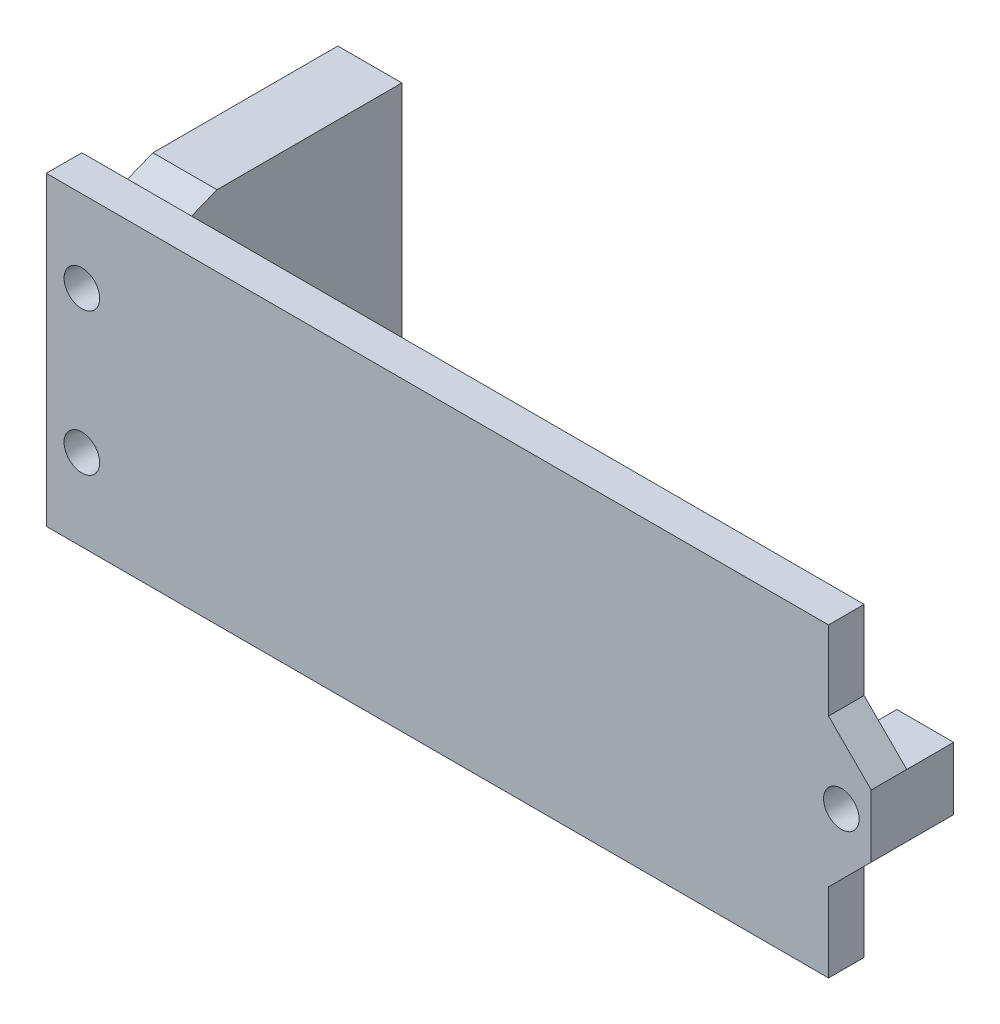
ISO-10303-21;
HEADER;
FILE_DESCRIPTION(('STEP AP214'),'2;1');
FILE_NAME('part.step','',(''),(''),'','','');
FILE_SCHEMA(('AUTOMOTIVE_DESIGN { 1 0 10303 214 1 1 1 1 }'));
ENDSEC;
DATA;
#1=APPLICATION_CONTEXT('core data for automotive mechanical design processes');
#2=APPLICATION_PROTOCOL_DEFINITION('international standard','automotive_design',2000,#1);
#3=PRODUCT_CONTEXT('',#1,'mechanical');
#4=PRODUCT('Part','Part','',(#3));
#5=PRODUCT_RELATED_PRODUCT_CATEGORY('part','',(#4));
#6=PRODUCT_DEFINITION_FORMATION('','',#4);
#7=PRODUCT_DEFINITION_CONTEXT('part definition',#1,'design');
#8=PRODUCT_DEFINITION('design','',#6,#7);
#9=PRODUCT_DEFINITION_SHAPE('','',#8);
#10=(LENGTH_UNIT() NAMED_UNIT(*) SI_UNIT(.MILLI.,.METRE.));
#11=(NAMED_UNIT(*) PLANE_ANGLE_UNIT() SI_UNIT($,.RADIAN.));
#12=(NAMED_UNIT(*) SI_UNIT($,.STERADIAN.) SOLID_ANGLE_UNIT());
#13=UNCERTAINTY_MEASURE_WITH_UNIT(LENGTH_MEASURE(1.E-05),#10,'distance_accuracy_value','');
#14=(GEOMETRIC_REPRESENTATION_CONTEXT(3) GLOBAL_UNCERTAINTY_ASSIGNED_CONTEXT((#13)) GLOBAL_UNIT_ASSIGNED_CONTEXT((#10,
#11,#12)) REPRESENTATION_CONTEXT('',''));
#15=CARTESIAN_POINT('',(0.,0.,0.));
#16=DIRECTION('',(0.,0.,1.));
#17=DIRECTION('',(1.,0.,0.));
#18=AXIS2_PLACEMENT_3D('',#15,#16,#17);
#19=CARTESIAN_POINT('',(0.,0.,3.175));
#20=DIRECTION('',(0.,-1.,0.));
#21=DIRECTION('',(1.,0.,0.));
#22=AXIS2_PLACEMENT_3D('',#19,#20,#21);
#23=PLANE('',#22);
#24=DIRECTION('',(1.,0.,0.));
#25=VECTOR('',#24,1.);
#26=CARTESIAN_POINT('',(-69.85,0.,-6.35));
#27=LINE('',#26,#25);
#28=CARTESIAN_POINT('',(-69.85,0.,-6.35));
#29=VERTEX_POINT('',#28);
#30=CARTESIAN_POINT('',(-64.135,0.,-6.35));
#31=VERTEX_POINT('',#30);
#32=EDGE_CURVE('E71',#29,#31,#27,.T.);
#33=ORIENTED_EDGE('',*,*,#32,.F.);
#34=DIRECTION('',(0.,0.,-1.));
#35=VECTOR('',#34,1.);
#36=CARTESIAN_POINT('',(-69.85,0.,3.175));
#37=LINE('',#36,#35);
#38=CARTESIAN_POINT('',(-69.85,0.,-22.86));
#39=VERTEX_POINT('',#38);
#40=EDGE_CURVE('E362',#29,#39,#37,.T.);
#41=ORIENTED_EDGE('',*,*,#40,.T.);
#42=DIRECTION('',(-1.,0.,0.));
#43=VECTOR('',#42,1.);
#44=CARTESIAN_POINT('',(0.,0.,-22.86));
#45=LINE('',#44,#43);
#46=CARTESIAN_POINT('',(-64.135,0.,-22.86));
#47=VERTEX_POINT('',#46);
#48=EDGE_CURVE('E304',#47,#39,#45,.T.);
#49=ORIENTED_EDGE('',*,*,#48,.F.);
#50=DIRECTION('',(0.,0.,1.));
#51=VECTOR('',#50,1.);
#52=CARTESIAN_POINT('',(-64.135,0.,-22.86));
#53=LINE('',#52,#51);
#54=EDGE_CURVE('E315',#47,#31,#53,.T.);
#55=ORIENTED_EDGE('',*,*,#54,.T.);
#56=EDGE_LOOP('',(#33,#41,#49,#55));
#57=FACE_BOUND('',#56,.T.);
#58=ADVANCED_FACE('F49',(#57),#23,.T.);
#59=CARTESIAN_POINT('',(0.,20.955,3.175));
#60=DIRECTION('',(0.,-1.,0.));
#61=DIRECTION('',(1.,0.,0.));
#62=AXIS2_PLACEMENT_3D('',#59,#60,#61);
#63=PLANE('',#62);
#64=DIRECTION('',(0.,0.,-1.));
#65=VECTOR('',#64,1.);
#66=CARTESIAN_POINT('',(-69.85,20.955,3.175));
#67=LINE('',#66,#65);
#68=CARTESIAN_POINT('',(-69.85,20.955,-6.35));
#69=VERTEX_POINT('',#68);
#70=CARTESIAN_POINT('',(-69.85,20.955,-22.86));
#71=VERTEX_POINT('',#70);
#72=EDGE_CURVE('E365',#69,#71,#67,.T.);
#73=ORIENTED_EDGE('',*,*,#72,.F.);
#74=DIRECTION('',(1.,0.,0.));
#75=VECTOR('',#74,1.);
#76=CARTESIAN_POINT('',(-69.85,20.955,-6.35));
#77=LINE('',#76,#75);
#78=CARTESIAN_POINT('',(-64.135,20.955,-6.35));
#79=VERTEX_POINT('',#78);
#80=EDGE_CURVE('E454',#69,#79,#77,.T.);
#81=ORIENTED_EDGE('',*,*,#80,.T.);
#82=DIRECTION('',(0.,0.,1.));
#83=VECTOR('',#82,1.);
#84=CARTESIAN_POINT('',(-64.135,20.955,-22.86));
#85=LINE('',#84,#83);
#86=CARTESIAN_POINT('',(-64.135,20.955,-22.86));
#87=VERTEX_POINT('',#86);
#88=EDGE_CURVE('E318',#87,#79,#85,.T.);
#89=ORIENTED_EDGE('',*,*,#88,.F.);
#90=DIRECTION('',(-1.,0.,0.));
#91=VECTOR('',#90,1.);
#92=CARTESIAN_POINT('',(0.,20.955,-22.86));
#93=LINE('',#92,#91);
#94=EDGE_CURVE('E311',#87,#71,#93,.T.);
#95=ORIENTED_EDGE('',*,*,#94,.T.);
#96=EDGE_LOOP('',(#73,#81,#89,#95));
#97=FACE_BOUND('',#96,.T.);
#98=ADVANCED_FACE('F489',(#97),#63,.F.);
#99=CARTESIAN_POINT('',(0.,0.,0.));
#100=DIRECTION('',(0.,0.,1.));
#101=DIRECTION('',(1.,0.,0.));
#102=AXIS2_PLACEMENT_3D('',#99,#100,#101);
#103=PLANE('',#102);
#104=DIRECTION('',(1.,0.,0.));
#105=VECTOR('',#104,1.);
#106=CARTESIAN_POINT('',(0.,13.2715,0.));
#107=LINE('',#106,#105);
#108=CARTESIAN_POINT('',(-1.27,13.2715,0.));
#109=VERTEX_POINT('',#108);
#110=CARTESIAN_POINT('',(3.81,13.2715,0.));
#111=VERTEX_POINT('',#110);
#112=EDGE_CURVE('E81',#109,#111,#107,.T.);
#113=ORIENTED_EDGE('',*,*,#112,.F.);
#114=DIRECTION('',(0.,-1.,0.));
#115=VECTOR('',#114,1.);
#116=CARTESIAN_POINT('',(-1.27,0.,0.));
#117=LINE('',#116,#115);
#118=CARTESIAN_POINT('',(-1.27,7.6835,0.));
#119=VERTEX_POINT('',#118);
#120=EDGE_CURVE('E251',#109,#119,#117,.T.);
#121=ORIENTED_EDGE('',*,*,#120,.T.);
#122=DIRECTION('',(1.,0.,0.));
#123=VECTOR('',#122,1.);
#124=CARTESIAN_POINT('',(0.,7.6835,0.));
#125=LINE('',#124,#123);
#126=CARTESIAN_POINT('',(3.81,7.6835,0.));
#127=VERTEX_POINT('',#126);
#128=EDGE_CURVE('E256',#119,#127,#125,.T.);
#129=ORIENTED_EDGE('',*,*,#128,.T.);
#130=DIRECTION('',(0.707106781186551,0.707106781186544,0.));
#131=VECTOR('',#130,1.);
#132=CARTESIAN_POINT('',(-1.93675000000001,1.93675000000003,0.));
#133=LINE('',#132,#131);
#134=CARTESIAN_POINT('',(0.,3.87350000000001,0.));
#135=VERTEX_POINT('',#134);
#136=EDGE_CURVE('E375',#127,#135,#133,.F.);
#137=ORIENTED_EDGE('',*,*,#136,.T.);
#138=DIRECTION('',(0.,1.,0.));
#139=VECTOR('',#138,1.);
#140=CARTESIAN_POINT('',(0.,0.,0.));
#141=LINE('',#140,#139);
#142=CARTESIAN_POINT('',(0.,-3.175,0.));
#143=VERTEX_POINT('',#142);
#144=EDGE_CURVE('E330',#143,#135,#141,.T.);
#145=ORIENTED_EDGE('',*,*,#144,.F.);
#146=DIRECTION('',(-1.,0.,0.));
#147=VECTOR('',#146,1.);
#148=CARTESIAN_POINT('',(-69.85,-3.17500000000001,0.));
#149=LINE('',#148,#147);
#150=CARTESIAN_POINT('',(-69.85,-3.17500000000001,0.));
#151=VERTEX_POINT('',#150);
#152=EDGE_CURVE('E429',#143,#151,#149,.T.);
#153=ORIENTED_EDGE('',*,*,#152,.T.);
#154=DIRECTION('',(0.,1.,0.));
#155=VECTOR('',#154,1.);
#156=CARTESIAN_POINT('',(-69.85,-3.17500000000001,0.));
#157=LINE('',#156,#155);
#158=CARTESIAN_POINT('',(-69.85,0.,0.));
#159=VERTEX_POINT('',#158);
#160=EDGE_CURVE('E434',#151,#159,#157,.T.);
#161=ORIENTED_EDGE('',*,*,#160,.T.);
#162=DIRECTION('',(-1.,0.,0.));
#163=VECTOR('',#162,1.);
#164=CARTESIAN_POINT('',(-69.85,0.,0.));
#165=LINE('',#164,#163);
#166=CARTESIAN_POINT('',(-64.135,0.,0.));
#167=VERTEX_POINT('',#166);
#168=EDGE_CURVE('E11',#167,#159,#165,.T.);
#169=ORIENTED_EDGE('',*,*,#168,.F.);
#170=DIRECTION('',(0.,-1.,0.));
#171=VECTOR('',#170,1.);
#172=CARTESIAN_POINT('',(-64.135,0.,0.));
#173=LINE('',#172,#171);
#174=CARTESIAN_POINT('',(-64.135,20.955,0.));
#175=VERTEX_POINT('',#174);
#176=EDGE_CURVE('E244',#175,#167,#173,.T.);
#177=ORIENTED_EDGE('',*,*,#176,.F.);
#178=DIRECTION('',(-1.,0.,0.));
#179=VECTOR('',#178,1.);
#180=CARTESIAN_POINT('',(-69.85,20.955,0.));
#181=LINE('',#180,#179);
#182=CARTESIAN_POINT('',(-69.85,20.955,0.));
#183=VERTEX_POINT('',#182);
#184=EDGE_CURVE('E60',#175,#183,#181,.T.);
#185=ORIENTED_EDGE('',*,*,#184,.T.);
#186=DIRECTION('',(0.,-1.,0.));
#187=VECTOR('',#186,1.);
#188=CARTESIAN_POINT('',(-69.85,24.13,0.));
#189=LINE('',#188,#187);
#190=CARTESIAN_POINT('',(-69.85,24.13,0.));
#191=VERTEX_POINT('',#190);
#192=EDGE_CURVE('E240',#191,#183,#189,.T.);
#193=ORIENTED_EDGE('',*,*,#192,.F.);
#194=DIRECTION('',(-1.,0.,0.));
#195=VECTOR('',#194,1.);
#196=CARTESIAN_POINT('',(-69.85,24.13,0.));
#197=LINE('',#196,#195);
#198=CARTESIAN_POINT('',(0.,24.13,0.));
#199=VERTEX_POINT('',#198);
#200=EDGE_CURVE('E252',#199,#191,#197,.T.);
#201=ORIENTED_EDGE('',*,*,#200,.F.);
#202=CARTESIAN_POINT('',(0.,17.0815,0.));
#203=VERTEX_POINT('',#202);
#204=EDGE_CURVE('E322',#203,#199,#141,.T.);
#205=ORIENTED_EDGE('',*,*,#204,.F.);
#206=DIRECTION('',(0.707106781186544,-0.707106781186551,0.));
#207=VECTOR('',#206,1.);
#208=CARTESIAN_POINT('',(8.54075000000001,8.54074999999992,0.));
#209=LINE('',#208,#207);
#210=EDGE_CURVE('E380',#203,#111,#209,.T.);
#211=ORIENTED_EDGE('',*,*,#210,.T.);
#212=EDGE_LOOP('',(#113,#121,#129,#137,#145,#153,#161,#169,#177,#185,#193,#201,#205,#211));
#213=FACE_BOUND('',#212,.T.);
#214=ADVANCED_FACE('F238',(#213),#103,.F.);
#215=CARTESIAN_POINT('',(0.,13.2715,3.175));
#216=DIRECTION('',(0.,1.,0.));
#217=DIRECTION('',(0.,0.,1.));
#218=AXIS2_PLACEMENT_3D('',#215,#216,#217);
#219=PLANE('',#218);
#220=ORIENTED_EDGE('',*,*,#112,.T.);
#221=DIRECTION('',(0.,0.,-1.));
#222=VECTOR('',#221,1.);
#223=CARTESIAN_POINT('',(3.81,13.2715,3.175));
#224=LINE('',#223,#222);
#225=CARTESIAN_POINT('',(3.81,13.2715,-4.191));
#226=VERTEX_POINT('',#225);
#227=EDGE_CURVE('E350',#111,#226,#224,.T.);
#228=ORIENTED_EDGE('',*,*,#227,.T.);
#229=DIRECTION('',(1.,0.,0.));
#230=VECTOR('',#229,1.);
#231=CARTESIAN_POINT('',(0.,13.2715,-4.191));
#232=LINE('',#231,#230);
#233=CARTESIAN_POINT('',(-1.27,13.2715,-4.191));
#234=VERTEX_POINT('',#233);
#235=EDGE_CURVE('E277',#234,#226,#232,.T.);
#236=ORIENTED_EDGE('',*,*,#235,.F.);
#237=DIRECTION('',(0.,0.,1.));
#238=VECTOR('',#237,1.);
#239=CARTESIAN_POINT('',(-1.27,13.2715,-4.191));
#240=LINE('',#239,#238);
#241=EDGE_CURVE('E286',#234,#109,#240,.T.);
#242=ORIENTED_EDGE('',*,*,#241,.T.);
#243=EDGE_LOOP('',(#220,#228,#236,#242));
#244=FACE_BOUND('',#243,.T.);
#245=ADVANCED_FACE('F526',(#244),#219,.T.);
#246=CARTESIAN_POINT('',(0.,0.,3.175));
#247=DIRECTION('',(-1.,0.,0.));
#248=DIRECTION('',(0.,0.,1.));
#249=AXIS2_PLACEMENT_3D('',#246,#247,#248);
#250=PLANE('',#249);
#251=DIRECTION('',(0.,1.,0.));
#252=VECTOR('',#251,1.);
#253=CARTESIAN_POINT('',(0.,0.,3.175));
#254=LINE('',#253,#252);
#255=CARTESIAN_POINT('',(0.,17.0815,3.175));
#256=VERTEX_POINT('',#255);
#257=CARTESIAN_POINT('',(0.,24.13,3.175));
#258=VERTEX_POINT('',#257);
#259=EDGE_CURVE('E326',#256,#258,#254,.T.);
#260=ORIENTED_EDGE('',*,*,#259,.F.);
#261=DIRECTION('',(0.,0.,-1.));
#262=VECTOR('',#261,1.);
#263=CARTESIAN_POINT('',(0.,17.0815,3.175));
#264=LINE('',#263,#262);
#265=EDGE_CURVE('E371',#256,#203,#264,.T.);
#266=ORIENTED_EDGE('',*,*,#265,.T.);
#267=ORIENTED_EDGE('',*,*,#204,.T.);
#268=DIRECTION('',(0.,0.,-1.));
#269=VECTOR('',#268,1.);
#270=CARTESIAN_POINT('',(0.,24.13,3.175));
#271=LINE('',#270,#269);
#272=EDGE_CURVE('E258',#258,#199,#271,.T.);
#273=ORIENTED_EDGE('',*,*,#272,.F.);
#274=EDGE_LOOP('',(#260,#266,#267,#273));
#275=FACE_BOUND('',#274,.T.);
#276=ADVANCED_FACE('F397',(#275),#250,.F.);
#277=CARTESIAN_POINT('',(-69.85,0.,3.175));
#278=DIRECTION('',(-1.,0.,0.));
#279=DIRECTION('',(0.,0.,1.));
#280=AXIS2_PLACEMENT_3D('',#277,#278,#279);
#281=PLANE('',#280);
#282=DIRECTION('',(0.,0.371390676354104,-0.928476690885259));
#283=VECTOR('',#282,1.);
#284=CARTESIAN_POINT('',(-69.85,19.685,-3.175));
#285=LINE('',#284,#283);
#286=CARTESIAN_POINT('',(-69.85,19.685,-3.175));
#287=VERTEX_POINT('',#286);
#288=EDGE_CURVE('E232',#287,#69,#285,.T.);
#289=ORIENTED_EDGE('',*,*,#288,.T.);
#290=ORIENTED_EDGE('',*,*,#72,.T.);
#291=DIRECTION('',(0.,1.,0.));
#292=VECTOR('',#291,1.);
#293=CARTESIAN_POINT('',(-69.85,0.,-22.86));
#294=LINE('',#293,#292);
#295=EDGE_CURVE('E300',#39,#71,#294,.T.);
#296=ORIENTED_EDGE('',*,*,#295,.F.);
#297=ORIENTED_EDGE('',*,*,#40,.F.);
#298=DIRECTION('',(0.,0.371390676354104,0.928476690885259));
#299=VECTOR('',#298,1.);
#300=CARTESIAN_POINT('',(-69.85,1.27000000000001,-3.175));
#301=LINE('',#300,#299);
#302=CARTESIAN_POINT('',(-69.85,1.27000000000001,-3.175));
#303=VERTEX_POINT('',#302);
#304=EDGE_CURVE('E462',#29,#303,#301,.T.);
#305=ORIENTED_EDGE('',*,*,#304,.T.);
#306=DIRECTION('',(0.,-0.371390676354105,0.928476690885259));
#307=VECTOR('',#306,1.);
#308=CARTESIAN_POINT('',(-69.85,0.,0.));
#309=LINE('',#308,#307);
#310=EDGE_CURVE('E469',#303,#159,#309,.T.);
#311=ORIENTED_EDGE('',*,*,#310,.T.);
#312=ORIENTED_EDGE('',*,*,#160,.F.);
#313=DIRECTION('',(0.,0.,1.));
#314=VECTOR('',#313,1.);
#315=CARTESIAN_POINT('',(-69.85,-3.17500000000001,3.175));
#316=LINE('',#315,#314);
#317=CARTESIAN_POINT('',(-69.85,-3.17500000000001,3.175));
#318=VERTEX_POINT('',#317);
#319=EDGE_CURVE('E436',#151,#318,#316,.T.);
#320=ORIENTED_EDGE('',*,*,#319,.T.);
#321=DIRECTION('',(0.,1.,0.));
#322=VECTOR('',#321,1.);
#323=CARTESIAN_POINT('',(-69.85,0.,3.175));
#324=LINE('',#323,#322);
#325=CARTESIAN_POINT('',(-69.85,24.13,3.175));
#326=VERTEX_POINT('',#325);
#327=EDGE_CURVE('E329',#318,#326,#324,.T.);
#328=ORIENTED_EDGE('',*,*,#327,.T.);
#329=DIRECTION('',(0.,0.,1.));
#330=VECTOR('',#329,1.);
#331=CARTESIAN_POINT('',(-69.85,24.13,3.175));
#332=LINE('',#331,#330);
#333=EDGE_CURVE('E249',#191,#326,#332,.T.);
#334=ORIENTED_EDGE('',*,*,#333,.F.);
#335=ORIENTED_EDGE('',*,*,#192,.T.);
#336=DIRECTION('',(0.,-0.371390676354105,-0.928476690885259));
#337=VECTOR('',#336,1.);
#338=CARTESIAN_POINT('',(-69.85,20.955,0.));
#339=LINE('',#338,#337);
#340=EDGE_CURVE('E221',#183,#287,#339,.T.);
#341=ORIENTED_EDGE('',*,*,#340,.T.);
#342=EDGE_LOOP('',(#289,#290,#296,#297,#305,#311,#312,#320,#328,#334,#335,#341));
#343=FACE_BOUND('',#342,.T.);
#344=ADVANCED_FACE('F247',(#343),#281,.T.);
#345=ORIENTED_EDGE('',*,*,#144,.T.);
#346=DIRECTION('',(0.,0.,1.));
#347=VECTOR('',#346,1.);
#348=CARTESIAN_POINT('',(0.,3.87350000000001,3.175));
#349=LINE('',#348,#347);
#350=CARTESIAN_POINT('',(0.,3.87350000000001,3.175));
#351=VERTEX_POINT('',#350);
#352=EDGE_CURVE('E368',#135,#351,#349,.T.);
#353=ORIENTED_EDGE('',*,*,#352,.T.);
#354=CARTESIAN_POINT('',(0.,-3.175,3.175));
#355=VERTEX_POINT('',#354);
#356=EDGE_CURVE('E331',#355,#351,#254,.T.);
#357=ORIENTED_EDGE('',*,*,#356,.F.);
#358=DIRECTION('',(0.,0.,-1.));
#359=VECTOR('',#358,1.);
#360=CARTESIAN_POINT('',(0.,-3.175,3.175));
#361=LINE('',#360,#359);
#362=EDGE_CURVE('E415',#355,#143,#361,.T.);
#363=ORIENTED_EDGE('',*,*,#362,.T.);
#364=EDGE_LOOP('',(#345,#353,#357,#363));
#365=FACE_BOUND('',#364,.T.);
#366=ADVANCED_FACE('F413',(#365),#250,.F.);
#367=CARTESIAN_POINT('',(0.,7.6835,3.175));
#368=DIRECTION('',(0.,1.,0.));
#369=DIRECTION('',(0.,0.,1.));
#370=AXIS2_PLACEMENT_3D('',#367,#368,#369);
#371=PLANE('',#370);
#372=DIRECTION('',(0.,0.,-1.));
#373=VECTOR('',#372,1.);
#374=CARTESIAN_POINT('',(3.81,7.6835,3.175));
#375=LINE('',#374,#373);
#376=CARTESIAN_POINT('',(3.81,7.6835,-4.191));
#377=VERTEX_POINT('',#376);
#378=EDGE_CURVE('E357',#127,#377,#375,.T.);
#379=ORIENTED_EDGE('',*,*,#378,.F.);
#380=ORIENTED_EDGE('',*,*,#128,.F.);
#381=DIRECTION('',(0.,0.,1.));
#382=VECTOR('',#381,1.);
#383=CARTESIAN_POINT('',(-1.27,7.6835,-4.191));
#384=LINE('',#383,#382);
#385=CARTESIAN_POINT('',(-1.27,7.6835,-4.191));
#386=VERTEX_POINT('',#385);
#387=EDGE_CURVE('E280',#386,#119,#384,.T.);
#388=ORIENTED_EDGE('',*,*,#387,.F.);
#389=DIRECTION('',(1.,0.,0.));
#390=VECTOR('',#389,1.);
#391=CARTESIAN_POINT('',(0.,7.6835,-4.191));
#392=LINE('',#391,#390);
#393=EDGE_CURVE('E269',#386,#377,#392,.T.);
#394=ORIENTED_EDGE('',*,*,#393,.T.);
#395=EDGE_LOOP('',(#379,#380,#388,#394));
#396=FACE_BOUND('',#395,.T.);
#397=ADVANCED_FACE('F566',(#396),#371,.F.);
#398=CARTESIAN_POINT('',(-66.675,4.12749999999999,3.175));
#399=DIRECTION('',(0.,0.,-1.));
#400=DIRECTION('',(-1.,0.,0.));
#401=AXIS2_PLACEMENT_3D('',#398,#399,#400);
#402=CYLINDRICAL_SURFACE('',#401,1.5875);
#403=CARTESIAN_POINT('',(-66.675,4.12749999999999,3.175));
#404=DIRECTION('',(0.,0.,1.));
#405=DIRECTION('',(1.,0.,0.));
#406=AXIS2_PLACEMENT_3D('',#403,#404,#405);
#407=CIRCLE('',#406,1.5875);
#408=CARTESIAN_POINT('',(-65.0875,4.12749999999999,3.175));
#409=VERTEX_POINT('',#408);
#410=EDGE_CURVE('E342',#409,#409,#407,.T.);
#411=ORIENTED_EDGE('',*,*,#410,.T.);
#412=EDGE_LOOP('',(#411));
#413=FACE_BOUND('',#412,.T.);
#414=CARTESIAN_POINT('',(-66.675,4.12749999999999,-22.86));
#415=DIRECTION('',(0.,0.,1.));
#416=DIRECTION('',(1.,0.,0.));
#417=AXIS2_PLACEMENT_3D('',#414,#415,#416);
#418=CIRCLE('',#417,1.5875);
#419=CARTESIAN_POINT('',(-65.0875,4.12749999999999,-22.86));
#420=VERTEX_POINT('',#419);
#421=EDGE_CURVE('E292',#420,#420,#418,.T.);
#422=ORIENTED_EDGE('',*,*,#421,.F.);
#423=EDGE_LOOP('',(#422));
#424=FACE_BOUND('',#423,.T.);
#425=ADVANCED_FACE('F562',(#413,#424),#402,.F.);
#426=CARTESIAN_POINT('',(1.143,10.4775,3.175));
#427=DIRECTION('',(0.,0.,-1.));
#428=DIRECTION('',(-1.,0.,0.));
#429=AXIS2_PLACEMENT_3D('',#426,#427,#428);
#430=CYLINDRICAL_SURFACE('',#429,1.5875);
#431=CARTESIAN_POINT('',(1.143,10.4775,3.175));
#432=DIRECTION('',(0.,0.,1.));
#433=DIRECTION('',(1.,0.,0.));
#434=AXIS2_PLACEMENT_3D('',#431,#432,#433);
#435=CIRCLE('',#434,1.5875);
#436=CARTESIAN_POINT('',(2.7305,10.4775,3.175));
#437=VERTEX_POINT('',#436);
#438=EDGE_CURVE('E338',#437,#437,#435,.T.);
#439=ORIENTED_EDGE('',*,*,#438,.T.);
#440=EDGE_LOOP('',(#439));
#441=FACE_BOUND('',#440,.T.);
#442=CARTESIAN_POINT('',(1.143,10.4775,-4.191));
#443=DIRECTION('',(0.,0.,1.));
#444=DIRECTION('',(1.,0.,0.));
#445=AXIS2_PLACEMENT_3D('',#442,#443,#444);
#446=CIRCLE('',#445,1.5875);
#447=CARTESIAN_POINT('',(2.7305,10.4775,-4.191));
#448=VERTEX_POINT('',#447);
#449=EDGE_CURVE('E261',#448,#448,#446,.T.);
#450=ORIENTED_EDGE('',*,*,#449,.F.);
#451=EDGE_LOOP('',(#450));
#452=FACE_BOUND('',#451,.T.);
#453=ADVANCED_FACE('F565',(#441,#452),#430,.F.);
#454=CARTESIAN_POINT('',(3.81,0.,3.175));
#455=DIRECTION('',(1.,0.,0.));
#456=DIRECTION('',(0.,0.,-1.));
#457=AXIS2_PLACEMENT_3D('',#454,#455,#456);
#458=PLANE('',#457);
#459=CARTESIAN_POINT('',(3.81,7.6835,3.175));
#460=VERTEX_POINT('',#459);
#461=EDGE_CURVE('E358',#460,#127,#375,.T.);
#462=ORIENTED_EDGE('',*,*,#461,.T.);
#463=ORIENTED_EDGE('',*,*,#378,.T.);
#464=DIRECTION('',(0.,-1.,0.));
#465=VECTOR('',#464,1.);
#466=CARTESIAN_POINT('',(3.81,0.,-4.191));
#467=LINE('',#466,#465);
#468=EDGE_CURVE('E273',#226,#377,#467,.T.);
#469=ORIENTED_EDGE('',*,*,#468,.F.);
#470=ORIENTED_EDGE('',*,*,#227,.F.);
#471=CARTESIAN_POINT('',(3.81,13.2715,3.175));
#472=VERTEX_POINT('',#471);
#473=EDGE_CURVE('E353',#472,#111,#224,.T.);
#474=ORIENTED_EDGE('',*,*,#473,.F.);
#475=DIRECTION('',(0.,-1.,0.));
#476=VECTOR('',#475,1.);
#477=CARTESIAN_POINT('',(3.81,0.,3.175));
#478=LINE('',#477,#476);
#479=EDGE_CURVE('E334',#472,#460,#478,.T.);
#480=ORIENTED_EDGE('',*,*,#479,.T.);
#481=EDGE_LOOP('',(#462,#463,#469,#470,#474,#480));
#482=FACE_BOUND('',#481,.T.);
#483=ADVANCED_FACE('F400',(#482),#458,.T.);
#484=CARTESIAN_POINT('',(-66.675,16.8275,3.175));
#485=DIRECTION('',(0.,0.,-1.));
#486=DIRECTION('',(-1.,0.,0.));
#487=AXIS2_PLACEMENT_3D('',#484,#485,#486);
#488=CYLINDRICAL_SURFACE('',#487,1.5875);
#489=CARTESIAN_POINT('',(-66.675,16.8275,3.175));
#490=DIRECTION('',(0.,0.,1.));
#491=DIRECTION('',(1.,0.,0.));
#492=AXIS2_PLACEMENT_3D('',#489,#490,#491);
#493=CIRCLE('',#492,1.5875);
#494=CARTESIAN_POINT('',(-65.0875,16.8275,3.175));
#495=VERTEX_POINT('',#494);
#496=EDGE_CURVE('E346',#495,#495,#493,.T.);
#497=ORIENTED_EDGE('',*,*,#496,.T.);
#498=EDGE_LOOP('',(#497));
#499=FACE_BOUND('',#498,.T.);
#500=CARTESIAN_POINT('',(-66.675,16.8275,-22.86));
#501=DIRECTION('',(0.,0.,1.));
#502=DIRECTION('',(1.,0.,0.));
#503=AXIS2_PLACEMENT_3D('',#500,#501,#502);
#504=CIRCLE('',#503,1.5875);
#505=CARTESIAN_POINT('',(-65.0875,16.8275,-22.86));
#506=VERTEX_POINT('',#505);
#507=EDGE_CURVE('E296',#506,#506,#504,.T.);
#508=ORIENTED_EDGE('',*,*,#507,.F.);
#509=EDGE_LOOP('',(#508));
#510=FACE_BOUND('',#509,.T.);
#511=ADVANCED_FACE('F556',(#499,#510),#488,.F.);
#512=CARTESIAN_POINT('',(0.,0.,3.175));
#513=DIRECTION('',(0.,0.,1.));
#514=DIRECTION('',(1.,0.,0.));
#515=AXIS2_PLACEMENT_3D('',#512,#513,#514);
#516=PLANE('',#515);
#517=ORIENTED_EDGE('',*,*,#479,.F.);
#518=DIRECTION('',(-0.707106781186544,0.707106781186551,0.));
#519=VECTOR('',#518,1.);
#520=CARTESIAN_POINT('',(0.,17.0815,3.175));
#521=LINE('',#520,#519);
#522=EDGE_CURVE('E54',#472,#256,#521,.T.);
#523=ORIENTED_EDGE('',*,*,#522,.T.);
#524=ORIENTED_EDGE('',*,*,#259,.T.);
#525=DIRECTION('',(1.,0.,0.));
#526=VECTOR('',#525,1.);
#527=CARTESIAN_POINT('',(-69.85,24.13,3.175));
#528=LINE('',#527,#526);
#529=EDGE_CURVE('E445',#326,#258,#528,.T.);
#530=ORIENTED_EDGE('',*,*,#529,.F.);
#531=ORIENTED_EDGE('',*,*,#327,.F.);
#532=DIRECTION('',(1.,0.,0.));
#533=VECTOR('',#532,1.);
#534=CARTESIAN_POINT('',(-69.85,-3.17500000000001,3.175));
#535=LINE('',#534,#533);
#536=EDGE_CURVE('E425',#318,#355,#535,.T.);
#537=ORIENTED_EDGE('',*,*,#536,.T.);
#538=ORIENTED_EDGE('',*,*,#356,.T.);
#539=DIRECTION('',(-0.707106781186551,-0.707106781186544,0.));
#540=VECTOR('',#539,1.);
#541=CARTESIAN_POINT('',(3.81000000000003,7.6835,3.175));
#542=LINE('',#541,#540);
#543=EDGE_CURVE('E378',#351,#460,#542,.F.);
#544=ORIENTED_EDGE('',*,*,#543,.T.);
#545=EDGE_LOOP('',(#517,#523,#524,#530,#531,#537,#538,#544));
#546=FACE_BOUND('',#545,.T.);
#547=ORIENTED_EDGE('',*,*,#438,.F.);
#548=EDGE_LOOP('',(#547));
#549=FACE_BOUND('',#548,.T.);
#550=ORIENTED_EDGE('',*,*,#410,.F.);
#551=EDGE_LOOP('',(#550));
#552=FACE_BOUND('',#551,.T.);
#553=ORIENTED_EDGE('',*,*,#496,.F.);
#554=EDGE_LOOP('',(#553));
#555=FACE_BOUND('',#554,.T.);
#556=ADVANCED_FACE('F389',(#546,#549,#552,#555),#516,.T.);
#557=CARTESIAN_POINT('',(-64.135,0.,-22.86));
#558=DIRECTION('',(-1.,0.,0.));
#559=DIRECTION('',(0.,0.,1.));
#560=AXIS2_PLACEMENT_3D('',#557,#558,#559);
#561=PLANE('',#560);
#562=ORIENTED_EDGE('',*,*,#88,.T.);
#563=DIRECTION('',(0.,0.371390676354104,-0.928476690885259));
#564=VECTOR('',#563,1.);
#565=CARTESIAN_POINT('',(-64.135,19.685,-3.175));
#566=LINE('',#565,#564);
#567=CARTESIAN_POINT('',(-64.135,19.685,-3.175));
#568=VERTEX_POINT('',#567);
#569=EDGE_CURVE('E233',#568,#79,#566,.T.);
#570=ORIENTED_EDGE('',*,*,#569,.F.);
#571=DIRECTION('',(0.,-0.371390676354105,-0.928476690885259));
#572=VECTOR('',#571,1.);
#573=CARTESIAN_POINT('',(-64.135,20.955,0.));
#574=LINE('',#573,#572);
#575=EDGE_CURVE('E465',#175,#568,#574,.T.);
#576=ORIENTED_EDGE('',*,*,#575,.F.);
#577=ORIENTED_EDGE('',*,*,#176,.T.);
#578=DIRECTION('',(0.,-0.371390676354105,0.928476690885259));
#579=VECTOR('',#578,1.);
#580=CARTESIAN_POINT('',(-64.135,0.,0.));
#581=LINE('',#580,#579);
#582=CARTESIAN_POINT('',(-64.135,1.27000000000001,-3.175));
#583=VERTEX_POINT('',#582);
#584=EDGE_CURVE('E470',#583,#167,#581,.T.);
#585=ORIENTED_EDGE('',*,*,#584,.F.);
#586=DIRECTION('',(0.,0.371390676354104,0.928476690885259));
#587=VECTOR('',#586,1.);
#588=CARTESIAN_POINT('',(-64.135,1.27000000000001,-3.175));
#589=LINE('',#588,#587);
#590=EDGE_CURVE('E466',#31,#583,#589,.T.);
#591=ORIENTED_EDGE('',*,*,#590,.F.);
#592=ORIENTED_EDGE('',*,*,#54,.F.);
#593=DIRECTION('',(0.,-1.,0.));
#594=VECTOR('',#593,1.);
#595=CARTESIAN_POINT('',(-64.135,0.,-22.86));
#596=LINE('',#595,#594);
#597=EDGE_CURVE('E308',#87,#47,#596,.T.);
#598=ORIENTED_EDGE('',*,*,#597,.F.);
#599=EDGE_LOOP('',(#562,#570,#576,#577,#585,#591,#592,#598));
#600=FACE_BOUND('',#599,.T.);
#601=ADVANCED_FACE('F499',(#600),#561,.F.);
#602=CARTESIAN_POINT('',(0.,0.,-22.86));
#603=DIRECTION('',(0.,0.,1.));
#604=DIRECTION('',(1.,0.,0.));
#605=AXIS2_PLACEMENT_3D('',#602,#603,#604);
#606=PLANE('',#605);
#607=ORIENTED_EDGE('',*,*,#421,.T.);
#608=EDGE_LOOP('',(#607));
#609=FACE_BOUND('',#608,.T.);
#610=ORIENTED_EDGE('',*,*,#507,.T.);
#611=EDGE_LOOP('',(#610));
#612=FACE_BOUND('',#611,.T.);
#613=ORIENTED_EDGE('',*,*,#295,.T.);
#614=ORIENTED_EDGE('',*,*,#94,.F.);
#615=ORIENTED_EDGE('',*,*,#597,.T.);
#616=ORIENTED_EDGE('',*,*,#48,.T.);
#617=EDGE_LOOP('',(#613,#614,#615,#616));
#618=FACE_BOUND('',#617,.T.);
#619=ADVANCED_FACE('F493',(#609,#612,#618),#606,.F.);
#620=CARTESIAN_POINT('',(-1.27,0.,-4.191));
#621=DIRECTION('',(-1.,0.,0.));
#622=DIRECTION('',(0.,0.,1.));
#623=AXIS2_PLACEMENT_3D('',#620,#621,#622);
#624=PLANE('',#623);
#625=ORIENTED_EDGE('',*,*,#120,.F.);
#626=ORIENTED_EDGE('',*,*,#241,.F.);
#627=DIRECTION('',(0.,-1.,0.));
#628=VECTOR('',#627,1.);
#629=CARTESIAN_POINT('',(-1.27,0.,-4.191));
#630=LINE('',#629,#628);
#631=EDGE_CURVE('E265',#234,#386,#630,.T.);
#632=ORIENTED_EDGE('',*,*,#631,.T.);
#633=ORIENTED_EDGE('',*,*,#387,.T.);
#634=EDGE_LOOP('',(#625,#626,#632,#633));
#635=FACE_BOUND('',#634,.T.);
#636=ADVANCED_FACE('F537',(#635),#624,.T.);
#637=CARTESIAN_POINT('',(0.,0.,-4.191));
#638=DIRECTION('',(0.,0.,1.));
#639=DIRECTION('',(1.,0.,0.));
#640=AXIS2_PLACEMENT_3D('',#637,#638,#639);
#641=PLANE('',#640);
#642=ORIENTED_EDGE('',*,*,#449,.T.);
#643=EDGE_LOOP('',(#642));
#644=FACE_BOUND('',#643,.T.);
#645=ORIENTED_EDGE('',*,*,#631,.F.);
#646=ORIENTED_EDGE('',*,*,#235,.T.);
#647=ORIENTED_EDGE('',*,*,#468,.T.);
#648=ORIENTED_EDGE('',*,*,#393,.F.);
#649=EDGE_LOOP('',(#645,#646,#647,#648));
#650=FACE_BOUND('',#649,.T.);
#651=ADVANCED_FACE('F532',(#644,#650),#641,.F.);
#652=CARTESIAN_POINT('',(3.81000000000003,7.6835,3.175));
#653=DIRECTION('',(0.707106781186544,-0.707106781186551,0.));
#654=DIRECTION('',(0.,0.,1.));
#655=AXIS2_PLACEMENT_3D('',#652,#653,#654);
#656=PLANE('',#655);
#657=ORIENTED_EDGE('',*,*,#543,.F.);
#658=ORIENTED_EDGE('',*,*,#352,.F.);
#659=ORIENTED_EDGE('',*,*,#136,.F.);
#660=ORIENTED_EDGE('',*,*,#461,.F.);
#661=EDGE_LOOP('',(#657,#658,#659,#660));
#662=FACE_BOUND('',#661,.T.);
#663=ADVANCED_FACE('F421',(#662),#656,.T.);
#664=CARTESIAN_POINT('',(0.,17.0815,3.175));
#665=DIRECTION('',(-0.707106781186551,-0.707106781186544,0.));
#666=DIRECTION('',(0.,0.,-1.));
#667=AXIS2_PLACEMENT_3D('',#664,#665,#666);
#668=PLANE('',#667);
#669=ORIENTED_EDGE('',*,*,#522,.F.);
#670=ORIENTED_EDGE('',*,*,#473,.T.);
#671=ORIENTED_EDGE('',*,*,#210,.F.);
#672=ORIENTED_EDGE('',*,*,#265,.F.);
#673=EDGE_LOOP('',(#669,#670,#671,#672));
#674=FACE_BOUND('',#673,.T.);
#675=ADVANCED_FACE('F52',(#674),#668,.F.);
#676=CARTESIAN_POINT('',(0.,24.13,0.));
#677=DIRECTION('',(0.,-1.,0.));
#678=DIRECTION('',(1.,0.,0.));
#679=AXIS2_PLACEMENT_3D('',#676,#677,#678);
#680=PLANE('',#679);
#681=ORIENTED_EDGE('',*,*,#333,.T.);
#682=ORIENTED_EDGE('',*,*,#529,.T.);
#683=ORIENTED_EDGE('',*,*,#272,.T.);
#684=ORIENTED_EDGE('',*,*,#200,.T.);
#685=EDGE_LOOP('',(#681,#682,#683,#684));
#686=FACE_BOUND('',#685,.T.);
#687=ADVANCED_FACE('F450',(#686),#680,.F.);
#688=CARTESIAN_POINT('',(0.,-3.175,0.));
#689=DIRECTION('',(0.,1.,0.));
#690=DIRECTION('',(1.,0.,0.));
#691=AXIS2_PLACEMENT_3D('',#688,#689,#690);
#692=PLANE('',#691);
#693=ORIENTED_EDGE('',*,*,#319,.F.);
#694=ORIENTED_EDGE('',*,*,#152,.F.);
#695=ORIENTED_EDGE('',*,*,#362,.F.);
#696=ORIENTED_EDGE('',*,*,#536,.F.);
#697=EDGE_LOOP('',(#693,#694,#695,#696));
#698=FACE_BOUND('',#697,.T.);
#699=ADVANCED_FACE('F428',(#698),#692,.F.);
#700=CARTESIAN_POINT('',(-69.85,0.,0.));
#701=DIRECTION('',(0.,0.928476690885259,0.371390676354105));
#702=DIRECTION('',(0.,-0.371390676354105,0.928476690885259));
#703=AXIS2_PLACEMENT_3D('',#700,#701,#702);
#704=PLANE('',#703);
#705=ORIENTED_EDGE('',*,*,#584,.T.);
#706=ORIENTED_EDGE('',*,*,#168,.T.);
#707=ORIENTED_EDGE('',*,*,#310,.F.);
#708=DIRECTION('',(1.,0.,0.));
#709=VECTOR('',#708,1.);
#710=CARTESIAN_POINT('',(-69.85,1.27000000000001,-3.175));
#711=LINE('',#710,#709);
#712=EDGE_CURVE('E461',#303,#583,#711,.T.);
#713=ORIENTED_EDGE('',*,*,#712,.T.);
#714=EDGE_LOOP('',(#705,#706,#707,#713));
#715=FACE_BOUND('',#714,.T.);
#716=ADVANCED_FACE('F504',(#715),#704,.F.);
#717=CARTESIAN_POINT('',(-69.85,1.27000000000001,-3.175));
#718=DIRECTION('',(0.,0.928476690885259,-0.371390676354104));
#719=DIRECTION('',(0.,0.371390676354104,0.928476690885259));
#720=AXIS2_PLACEMENT_3D('',#717,#718,#719);
#721=PLANE('',#720);
#722=ORIENTED_EDGE('',*,*,#590,.T.);
#723=ORIENTED_EDGE('',*,*,#712,.F.);
#724=ORIENTED_EDGE('',*,*,#304,.F.);
#725=ORIENTED_EDGE('',*,*,#32,.T.);
#726=EDGE_LOOP('',(#722,#723,#724,#725));
#727=FACE_BOUND('',#726,.T.);
#728=ADVANCED_FACE('F501',(#727),#721,.F.);
#729=CARTESIAN_POINT('',(-69.85,19.685,-3.175));
#730=DIRECTION('',(0.,-0.928476690885259,-0.371390676354104));
#731=DIRECTION('',(0.,0.371390676354104,-0.928476690885259));
#732=AXIS2_PLACEMENT_3D('',#729,#730,#731);
#733=PLANE('',#732);
#734=ORIENTED_EDGE('',*,*,#569,.T.);
#735=ORIENTED_EDGE('',*,*,#80,.F.);
#736=ORIENTED_EDGE('',*,*,#288,.F.);
#737=DIRECTION('',(1.,0.,0.));
#738=VECTOR('',#737,1.);
#739=CARTESIAN_POINT('',(-69.85,19.685,-3.175));
#740=LINE('',#739,#738);
#741=EDGE_CURVE('E226',#287,#568,#740,.T.);
#742=ORIENTED_EDGE('',*,*,#741,.T.);
#743=EDGE_LOOP('',(#734,#735,#736,#742));
#744=FACE_BOUND('',#743,.T.);
#745=ADVANCED_FACE('F506',(#744),#733,.F.);
#746=CARTESIAN_POINT('',(-69.85,20.955,0.));
#747=DIRECTION('',(0.,-0.928476690885259,0.371390676354105));
#748=DIRECTION('',(0.,-0.371390676354105,-0.928476690885259));
#749=AXIS2_PLACEMENT_3D('',#746,#747,#748);
#750=PLANE('',#749);
#751=ORIENTED_EDGE('',*,*,#575,.T.);
#752=ORIENTED_EDGE('',*,*,#741,.F.);
#753=ORIENTED_EDGE('',*,*,#340,.F.);
#754=ORIENTED_EDGE('',*,*,#184,.F.);
#755=EDGE_LOOP('',(#751,#752,#753,#754));
#756=FACE_BOUND('',#755,.T.);
#757=ADVANCED_FACE('F224',(#756),#750,.F.);
#758=CLOSED_SHELL('',(#58,#98,#214,#245,#276,#344,#366,#397,#425,#453,#483,#511,#556,#601,#619,
#636,#651,#663,#675,#687,#699,#716,#728,#745,#757));
#759=MANIFOLD_SOLID_BREP('B2',#758);
#760=ADVANCED_BREP_SHAPE_REPRESENTATION('',(#18,#759),#14);
#761=SHAPE_DEFINITION_REPRESENTATION(#9,#760);
ENDSEC;
END-ISO-10303-21;
